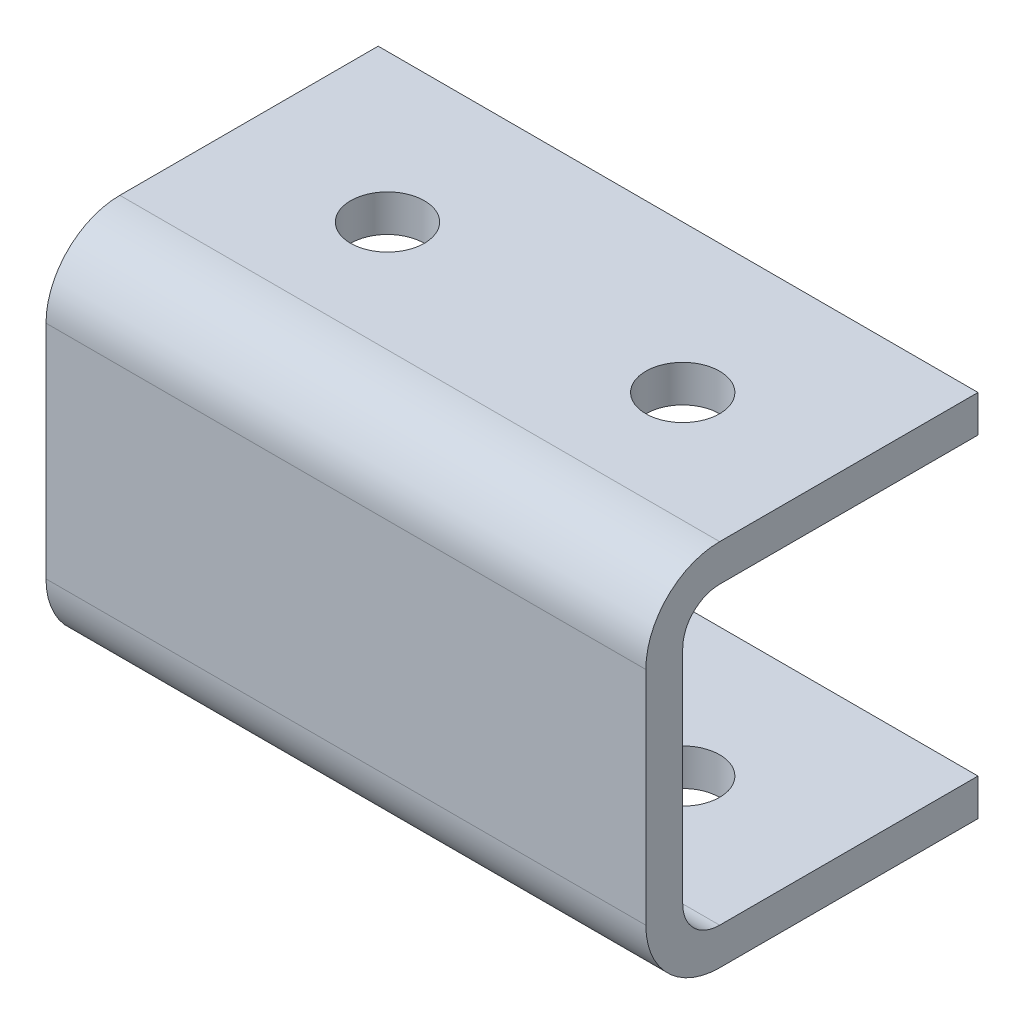
ISO-10303-21;
HEADER;
FILE_DESCRIPTION(('STEP AP214'),'2;1');
FILE_NAME('part.step','',(''),(''),'','','');
FILE_SCHEMA(('AUTOMOTIVE_DESIGN { 1 0 10303 214 1 1 1 1 }'));
ENDSEC;
DATA;
#1=APPLICATION_CONTEXT('core data for automotive mechanical design processes');
#2=APPLICATION_PROTOCOL_DEFINITION('international standard','automotive_design',2000,#1);
#3=PRODUCT_CONTEXT('',#1,'mechanical');
#4=PRODUCT('Part','Part','',(#3));
#5=PRODUCT_RELATED_PRODUCT_CATEGORY('part','',(#4));
#6=PRODUCT_DEFINITION_FORMATION('','',#4);
#7=PRODUCT_DEFINITION_CONTEXT('part definition',#1,'design');
#8=PRODUCT_DEFINITION('design','',#6,#7);
#9=PRODUCT_DEFINITION_SHAPE('','',#8);
#10=(LENGTH_UNIT() NAMED_UNIT(*) SI_UNIT(.MILLI.,.METRE.));
#11=(NAMED_UNIT(*) PLANE_ANGLE_UNIT() SI_UNIT($,.RADIAN.));
#12=(NAMED_UNIT(*) SI_UNIT($,.STERADIAN.) SOLID_ANGLE_UNIT());
#13=UNCERTAINTY_MEASURE_WITH_UNIT(LENGTH_MEASURE(1.E-05),#10,'distance_accuracy_value','');
#14=(GEOMETRIC_REPRESENTATION_CONTEXT(3) GLOBAL_UNCERTAINTY_ASSIGNED_CONTEXT((#13)) GLOBAL_UNIT_ASSIGNED_CONTEXT((#10,
#11,#12)) REPRESENTATION_CONTEXT('',''));
#15=CARTESIAN_POINT('',(0.,0.,0.));
#16=DIRECTION('',(0.,0.,1.));
#17=DIRECTION('',(1.,0.,0.));
#18=AXIS2_PLACEMENT_3D('',#15,#16,#17);
#19=CARTESIAN_POINT('',(872.981011996506,-4.02704283352276,-25.4));
#20=DIRECTION('',(0.,-1.,0.));
#21=DIRECTION('',(0.,0.,-1.));
#22=AXIS2_PLACEMENT_3D('',#19,#20,#21);
#23=PLANE('',#22);
#24=CARTESIAN_POINT('',(860.280011996506,-4.02704283352274,-12.7000000000001));
#25=DIRECTION('',(0.,1.,0.));
#26=DIRECTION('',(0.,0.,1.));
#27=AXIS2_PLACEMENT_3D('',#24,#25,#26);
#28=CIRCLE('',#27,3.17500000000001);
#29=CARTESIAN_POINT('',(860.280011996506,-4.02704283352273,-9.52500000000011));
#30=VERTEX_POINT('',#29);
#31=EDGE_CURVE('E175',#30,#30,#28,.T.);
#32=ORIENTED_EDGE('',*,*,#31,.F.);
#33=EDGE_LOOP('',(#32));
#34=FACE_BOUND('',#33,.T.);
#35=CARTESIAN_POINT('',(834.880011996506,-4.02704283352274,-12.7000000000001));
#36=DIRECTION('',(0.,1.,0.));
#37=DIRECTION('',(0.,0.,1.));
#38=AXIS2_PLACEMENT_3D('',#35,#36,#37);
#39=CIRCLE('',#38,3.17500000000001);
#40=CARTESIAN_POINT('',(834.880011996506,-4.02704283352273,-9.52500000000011));
#41=VERTEX_POINT('',#40);
#42=EDGE_CURVE('E169',#41,#41,#39,.T.);
#43=ORIENTED_EDGE('',*,*,#42,.F.);
#44=EDGE_LOOP('',(#43));
#45=FACE_BOUND('',#44,.T.);
#46=DIRECTION('',(-1.,0.,0.));
#47=VECTOR('',#46,1.);
#48=CARTESIAN_POINT('',(872.981011996506,-4.02704283352276,-25.4));
#49=LINE('',#48,#47);
#50=CARTESIAN_POINT('',(872.980011996506,-4.02704283352276,-25.4));
#51=VERTEX_POINT('',#50);
#52=CARTESIAN_POINT('',(821.380011996506,-4.02704283352282,-25.4));
#53=VERTEX_POINT('',#52);
#54=EDGE_CURVE('E155',#51,#53,#49,.T.);
#55=ORIENTED_EDGE('',*,*,#54,.T.);
#56=DIRECTION('',(0.,0.,1.));
#57=VECTOR('',#56,1.);
#58=CARTESIAN_POINT('',(821.380011996506,-4.02704283352276,-25.4));
#59=LINE('',#58,#57);
#60=CARTESIAN_POINT('',(821.380011996506,-4.02704283352272,-3.17499999999999));
#61=VERTEX_POINT('',#60);
#62=EDGE_CURVE('E287',#53,#61,#59,.T.);
#63=ORIENTED_EDGE('',*,*,#62,.T.);
#64=DIRECTION('',(-1.,0.,0.));
#65=VECTOR('',#64,1.);
#66=CARTESIAN_POINT('',(872.980011996506,-4.02704283352272,-3.17499999999999));
#67=LINE('',#66,#65);
#68=CARTESIAN_POINT('',(872.980011996506,-4.02704283352272,-3.17499999999999));
#69=VERTEX_POINT('',#68);
#70=EDGE_CURVE('E191',#61,#69,#67,.F.);
#71=ORIENTED_EDGE('',*,*,#70,.T.);
#72=DIRECTION('',(0.,0.,1.));
#73=VECTOR('',#72,1.);
#74=CARTESIAN_POINT('',(872.980011996506,-4.02704283352276,-25.4));
#75=LINE('',#74,#73);
#76=EDGE_CURVE('E285',#51,#69,#75,.T.);
#77=ORIENTED_EDGE('',*,*,#76,.F.);
#78=EDGE_LOOP('',(#55,#63,#71,#77));
#79=FACE_BOUND('',#78,.T.);
#80=ADVANCED_FACE('F34',(#34,#45,#79),#23,.F.);
#81=CARTESIAN_POINT('',(872.980011996506,-7.20204283352271,-25.4));
#82=DIRECTION('',(0.,0.,1.));
#83=DIRECTION('',(1.,0.,0.));
#84=AXIS2_PLACEMENT_3D('',#81,#82,#83);
#85=PLANE('',#84);
#86=DIRECTION('',(-1.,0.,0.));
#87=VECTOR('',#86,1.);
#88=CARTESIAN_POINT('',(872.981011996506,21.3729571664772,-25.4));
#89=LINE('',#88,#87);
#90=CARTESIAN_POINT('',(872.980011996506,21.3729571664772,-25.4));
#91=VERTEX_POINT('',#90);
#92=CARTESIAN_POINT('',(821.380011996506,21.3729571664772,-25.4));
#93=VERTEX_POINT('',#92);
#94=EDGE_CURVE('E135',#91,#93,#89,.T.);
#95=ORIENTED_EDGE('',*,*,#94,.T.);
#96=DIRECTION('',(0.,1.,0.));
#97=VECTOR('',#96,1.);
#98=CARTESIAN_POINT('',(821.380011996506,-161.452042833523,-25.4));
#99=LINE('',#98,#97);
#100=CARTESIAN_POINT('',(821.380011996506,24.5479571664772,-25.4));
#101=VERTEX_POINT('',#100);
#102=EDGE_CURVE('E124',#93,#101,#99,.T.);
#103=ORIENTED_EDGE('',*,*,#102,.T.);
#104=DIRECTION('',(-1.,0.,0.));
#105=VECTOR('',#104,1.);
#106=CARTESIAN_POINT('',(872.980011996506,24.5479571664772,-25.4));
#107=LINE('',#106,#105);
#108=CARTESIAN_POINT('',(872.980011996506,24.5479571664772,-25.4));
#109=VERTEX_POINT('',#108);
#110=EDGE_CURVE('E133',#109,#101,#107,.T.);
#111=ORIENTED_EDGE('',*,*,#110,.F.);
#112=DIRECTION('',(0.,1.,0.));
#113=VECTOR('',#112,1.);
#114=CARTESIAN_POINT('',(872.980011996506,-7.20204283352271,-25.4));
#115=LINE('',#114,#113);
#116=EDGE_CURVE('E147',#91,#109,#115,.T.);
#117=ORIENTED_EDGE('',*,*,#116,.F.);
#118=EDGE_LOOP('',(#95,#103,#111,#117));
#119=FACE_BOUND('',#118,.T.);
#120=ADVANCED_FACE('F131',(#119),#85,.F.);
#121=CARTESIAN_POINT('',(-16.0199880034941,-7.20204283352271,-25.4));
#122=DIRECTION('',(0.,-1.,0.));
#123=DIRECTION('',(0.,0.,-1.));
#124=AXIS2_PLACEMENT_3D('',#121,#122,#123);
#125=PLANE('',#124);
#126=DIRECTION('',(0.,0.,1.));
#127=VECTOR('',#126,1.);
#128=CARTESIAN_POINT('',(821.380011996506,-7.20204283352271,-25.4));
#129=LINE('',#128,#127);
#130=CARTESIAN_POINT('',(821.380011996506,-7.20204283352283,-25.4));
#131=VERTEX_POINT('',#130);
#132=CARTESIAN_POINT('',(821.380011996506,-7.20204283352271,-3.175));
#133=VERTEX_POINT('',#132);
#134=EDGE_CURVE('E317',#131,#133,#129,.T.);
#135=ORIENTED_EDGE('',*,*,#134,.F.);
#136=DIRECTION('',(1.,0.,0.));
#137=VECTOR('',#136,1.);
#138=CARTESIAN_POINT('',(-16.0199880034941,-7.20204283352271,-25.4));
#139=LINE('',#138,#137);
#140=CARTESIAN_POINT('',(872.980011996506,-7.20204283352271,-25.4));
#141=VERTEX_POINT('',#140);
#142=EDGE_CURVE('E154',#131,#141,#139,.T.);
#143=ORIENTED_EDGE('',*,*,#142,.T.);
#144=DIRECTION('',(0.,0.,1.));
#145=VECTOR('',#144,1.);
#146=CARTESIAN_POINT('',(872.980011996506,-7.20204283352271,-25.4));
#147=LINE('',#146,#145);
#148=CARTESIAN_POINT('',(872.980011996506,-7.20204283352271,-3.175));
#149=VERTEX_POINT('',#148);
#150=EDGE_CURVE('E141',#141,#149,#147,.T.);
#151=ORIENTED_EDGE('',*,*,#150,.T.);
#152=DIRECTION('',(1.,0.,0.));
#153=VECTOR('',#152,1.);
#154=CARTESIAN_POINT('',(-16.0199880034941,-7.20204283352271,-3.175));
#155=LINE('',#154,#153);
#156=EDGE_CURVE('E199',#149,#133,#155,.F.);
#157=ORIENTED_EDGE('',*,*,#156,.T.);
#158=EDGE_LOOP('',(#135,#143,#151,#157));
#159=FACE_BOUND('',#158,.T.);
#160=CARTESIAN_POINT('',(860.280011996506,-7.20204283352271,-12.7000000000001));
#161=DIRECTION('',(0.,-1.,0.));
#162=DIRECTION('',(0.,0.,-1.));
#163=AXIS2_PLACEMENT_3D('',#160,#161,#162);
#164=CIRCLE('',#163,3.17500000000001);
#165=CARTESIAN_POINT('',(860.280011996506,-7.20204283352271,-15.8750000000001));
#166=VERTEX_POINT('',#165);
#167=EDGE_CURVE('E178',#166,#166,#164,.T.);
#168=ORIENTED_EDGE('',*,*,#167,.F.);
#169=EDGE_LOOP('',(#168));
#170=FACE_BOUND('',#169,.T.);
#171=CARTESIAN_POINT('',(834.880011996506,-7.20204283352271,-12.7000000000001));
#172=DIRECTION('',(0.,-1.,0.));
#173=DIRECTION('',(0.,0.,-1.));
#174=AXIS2_PLACEMENT_3D('',#171,#172,#173);
#175=CIRCLE('',#174,3.17500000000001);
#176=CARTESIAN_POINT('',(834.880011996506,-7.20204283352271,-15.8750000000001));
#177=VERTEX_POINT('',#176);
#178=EDGE_CURVE('E172',#177,#177,#175,.T.);
#179=ORIENTED_EDGE('',*,*,#178,.F.);
#180=EDGE_LOOP('',(#179));
#181=FACE_BOUND('',#180,.T.);
#182=ADVANCED_FACE('F233',(#159,#170,#181),#125,.T.);
#183=CARTESIAN_POINT('',(872.980011996506,24.5479571664772,-25.4));
#184=DIRECTION('',(0.,1.,0.));
#185=DIRECTION('',(-1.,0.,0.));
#186=AXIS2_PLACEMENT_3D('',#183,#184,#185);
#187=PLANE('',#186);
#188=DIRECTION('',(0.,0.,-1.));
#189=VECTOR('',#188,1.);
#190=CARTESIAN_POINT('',(821.380011996506,24.5479571664772,-25.4));
#191=LINE('',#190,#189);
#192=CARTESIAN_POINT('',(821.380011996506,24.5479571664772,-3.175));
#193=VERTEX_POINT('',#192);
#194=EDGE_CURVE('E121',#193,#101,#191,.T.);
#195=ORIENTED_EDGE('',*,*,#194,.F.);
#196=DIRECTION('',(-1.,0.,0.));
#197=VECTOR('',#196,1.);
#198=CARTESIAN_POINT('',(872.980011996506,24.5479571664772,-3.175));
#199=LINE('',#198,#197);
#200=CARTESIAN_POINT('',(872.980011996506,24.5479571664772,-3.175));
#201=VERTEX_POINT('',#200);
#202=EDGE_CURVE('E56',#193,#201,#199,.F.);
#203=ORIENTED_EDGE('',*,*,#202,.T.);
#204=DIRECTION('',(0.,0.,1.));
#205=VECTOR('',#204,1.);
#206=CARTESIAN_POINT('',(872.980011996506,24.5479571664772,-25.4));
#207=LINE('',#206,#205);
#208=EDGE_CURVE('E140',#109,#201,#207,.T.);
#209=ORIENTED_EDGE('',*,*,#208,.F.);
#210=ORIENTED_EDGE('',*,*,#110,.T.);
#211=EDGE_LOOP('',(#195,#203,#209,#210));
#212=FACE_BOUND('',#211,.T.);
#213=CARTESIAN_POINT('',(860.280011996506,24.5479571664772,-12.7000000000001));
#214=DIRECTION('',(0.,1.,0.));
#215=DIRECTION('',(0.,0.,1.));
#216=AXIS2_PLACEMENT_3D('',#213,#214,#215);
#217=CIRCLE('',#216,3.17500000000001);
#218=CARTESIAN_POINT('',(860.280011996506,24.5479571664772,-9.52500000000005));
#219=VERTEX_POINT('',#218);
#220=EDGE_CURVE('E166',#219,#219,#217,.T.);
#221=ORIENTED_EDGE('',*,*,#220,.F.);
#222=EDGE_LOOP('',(#221));
#223=FACE_BOUND('',#222,.T.);
#224=CARTESIAN_POINT('',(834.880011996506,24.5479571664772,-12.7000000000001));
#225=DIRECTION('',(0.,1.,0.));
#226=DIRECTION('',(0.,0.,1.));
#227=AXIS2_PLACEMENT_3D('',#224,#225,#226);
#228=CIRCLE('',#227,3.17500000000001);
#229=CARTESIAN_POINT('',(834.880011996506,24.5479571664772,-9.52500000000005));
#230=VERTEX_POINT('',#229);
#231=EDGE_CURVE('E160',#230,#230,#228,.T.);
#232=ORIENTED_EDGE('',*,*,#231,.F.);
#233=EDGE_LOOP('',(#232));
#234=FACE_BOUND('',#233,.T.);
#235=ADVANCED_FACE('F138',(#212,#223,#234),#187,.T.);
#236=ORIENTED_EDGE('',*,*,#142,.F.);
#237=EDGE_CURVE('E136',#131,#53,#99,.T.);
#238=ORIENTED_EDGE('',*,*,#237,.T.);
#239=ORIENTED_EDGE('',*,*,#54,.F.);
#240=EDGE_CURVE('E142',#141,#51,#115,.T.);
#241=ORIENTED_EDGE('',*,*,#240,.F.);
#242=EDGE_LOOP('',(#236,#238,#239,#241));
#243=FACE_BOUND('',#242,.T.);
#244=ADVANCED_FACE('F235',(#243),#85,.F.);
#245=CARTESIAN_POINT('',(872.980011996506,-7.20204283352271,3.175));
#246=DIRECTION('',(0.,0.,1.));
#247=DIRECTION('',(1.,0.,0.));
#248=AXIS2_PLACEMENT_3D('',#245,#246,#247);
#249=PLANE('',#248);
#250=DIRECTION('',(0.,1.,0.));
#251=VECTOR('',#250,1.);
#252=CARTESIAN_POINT('',(821.380011996506,-7.20204283352271,3.175));
#253=LINE('',#252,#251);
#254=CARTESIAN_POINT('',(821.380011996506,-0.852042833522709,3.175));
#255=VERTEX_POINT('',#254);
#256=CARTESIAN_POINT('',(821.380011996506,18.1979571664772,3.175));
#257=VERTEX_POINT('',#256);
#258=EDGE_CURVE('E48',#255,#257,#253,.T.);
#259=ORIENTED_EDGE('',*,*,#258,.F.);
#260=DIRECTION('',(1.,0.,0.));
#261=VECTOR('',#260,1.);
#262=CARTESIAN_POINT('',(872.980011996506,-0.852042833522709,3.175));
#263=LINE('',#262,#261);
#264=CARTESIAN_POINT('',(872.980011996506,-0.852042833522709,3.175));
#265=VERTEX_POINT('',#264);
#266=EDGE_CURVE('E195',#255,#265,#263,.T.);
#267=ORIENTED_EDGE('',*,*,#266,.T.);
#268=DIRECTION('',(0.,1.,0.));
#269=VECTOR('',#268,1.);
#270=CARTESIAN_POINT('',(872.980011996506,-7.20204283352271,3.175));
#271=LINE('',#270,#269);
#272=CARTESIAN_POINT('',(872.980011996506,18.1979571664772,3.175));
#273=VERTEX_POINT('',#272);
#274=EDGE_CURVE('E151',#265,#273,#271,.T.);
#275=ORIENTED_EDGE('',*,*,#274,.T.);
#276=DIRECTION('',(-1.,0.,0.));
#277=VECTOR('',#276,1.);
#278=CARTESIAN_POINT('',(872.980011996506,18.1979571664772,3.175));
#279=LINE('',#278,#277);
#280=EDGE_CURVE('E202',#273,#257,#279,.T.);
#281=ORIENTED_EDGE('',*,*,#280,.T.);
#282=EDGE_LOOP('',(#259,#267,#275,#281));
#283=FACE_BOUND('',#282,.T.);
#284=ADVANCED_FACE('F212',(#283),#249,.T.);
#285=CARTESIAN_POINT('',(872.981011996506,21.3729571664772,0.));
#286=DIRECTION('',(0.,1.,0.));
#287=DIRECTION('',(0.,0.,1.));
#288=AXIS2_PLACEMENT_3D('',#285,#286,#287);
#289=PLANE('',#288);
#290=CARTESIAN_POINT('',(860.280011996506,21.3729571664772,-12.7000000000001));
#291=DIRECTION('',(0.,1.,0.));
#292=DIRECTION('',(0.,0.,1.));
#293=AXIS2_PLACEMENT_3D('',#290,#291,#292);
#294=CIRCLE('',#293,3.17500000000001);
#295=CARTESIAN_POINT('',(860.280011996506,21.3729571664772,-9.52500000000005));
#296=VERTEX_POINT('',#295);
#297=EDGE_CURVE('E163',#296,#296,#294,.T.);
#298=ORIENTED_EDGE('',*,*,#297,.T.);
#299=EDGE_LOOP('',(#298));
#300=FACE_BOUND('',#299,.T.);
#301=CARTESIAN_POINT('',(834.880011996506,21.3729571664772,-12.7000000000001));
#302=DIRECTION('',(0.,1.,0.));
#303=DIRECTION('',(0.,0.,1.));
#304=AXIS2_PLACEMENT_3D('',#301,#302,#303);
#305=CIRCLE('',#304,3.17500000000001);
#306=CARTESIAN_POINT('',(834.880011996506,21.3729571664772,-9.52500000000005));
#307=VERTEX_POINT('',#306);
#308=EDGE_CURVE('E156',#307,#307,#305,.T.);
#309=ORIENTED_EDGE('',*,*,#308,.T.);
#310=EDGE_LOOP('',(#309));
#311=FACE_BOUND('',#310,.T.);
#312=DIRECTION('',(-1.,0.,0.));
#313=VECTOR('',#312,1.);
#314=CARTESIAN_POINT('',(-16.0199880034941,21.3729571664772,-3.175));
#315=LINE('',#314,#313);
#316=CARTESIAN_POINT('',(872.980011996506,21.3729571664772,-3.175));
#317=VERTEX_POINT('',#316);
#318=CARTESIAN_POINT('',(821.380011996506,21.3729571664772,-3.175));
#319=VERTEX_POINT('',#318);
#320=EDGE_CURVE('E181',#317,#319,#315,.T.);
#321=ORIENTED_EDGE('',*,*,#320,.T.);
#322=DIRECTION('',(0.,0.,-1.));
#323=VECTOR('',#322,1.);
#324=CARTESIAN_POINT('',(821.380011996506,21.3729571664772,0.));
#325=LINE('',#324,#323);
#326=EDGE_CURVE('E293',#319,#93,#325,.T.);
#327=ORIENTED_EDGE('',*,*,#326,.T.);
#328=ORIENTED_EDGE('',*,*,#94,.F.);
#329=DIRECTION('',(0.,0.,-1.));
#330=VECTOR('',#329,1.);
#331=CARTESIAN_POINT('',(872.980011996506,21.3729571664772,0.));
#332=LINE('',#331,#330);
#333=EDGE_CURVE('E295',#317,#91,#332,.T.);
#334=ORIENTED_EDGE('',*,*,#333,.F.);
#335=EDGE_LOOP('',(#321,#327,#328,#334));
#336=FACE_BOUND('',#335,.T.);
#337=ADVANCED_FACE('F242',(#300,#311,#336),#289,.F.);
#338=CARTESIAN_POINT('',(872.981011996506,-4.02704283352271,0.));
#339=DIRECTION('',(0.,0.,1.));
#340=DIRECTION('',(1.,0.,0.));
#341=AXIS2_PLACEMENT_3D('',#338,#339,#340);
#342=PLANE('',#341);
#343=DIRECTION('',(-1.,0.,0.));
#344=VECTOR('',#343,1.);
#345=CARTESIAN_POINT('',(-16.0199880034941,-0.852042833522716,0.));
#346=LINE('',#345,#344);
#347=CARTESIAN_POINT('',(872.980011996506,-0.852042833522716,0.));
#348=VERTEX_POINT('',#347);
#349=CARTESIAN_POINT('',(821.380011996506,-0.852042833522716,0.));
#350=VERTEX_POINT('',#349);
#351=EDGE_CURVE('E188',#348,#350,#346,.T.);
#352=ORIENTED_EDGE('',*,*,#351,.T.);
#353=DIRECTION('',(0.,1.,0.));
#354=VECTOR('',#353,1.);
#355=CARTESIAN_POINT('',(821.380011996506,-4.02704283352271,0.));
#356=LINE('',#355,#354);
#357=CARTESIAN_POINT('',(821.380011996506,18.1979571664772,0.));
#358=VERTEX_POINT('',#357);
#359=EDGE_CURVE('E312',#350,#358,#356,.T.);
#360=ORIENTED_EDGE('',*,*,#359,.T.);
#361=DIRECTION('',(-1.,0.,0.));
#362=VECTOR('',#361,1.);
#363=CARTESIAN_POINT('',(872.980011996506,18.1979571664772,0.));
#364=LINE('',#363,#362);
#365=CARTESIAN_POINT('',(872.980011996506,18.1979571664772,0.));
#366=VERTEX_POINT('',#365);
#367=EDGE_CURVE('E184',#358,#366,#364,.F.);
#368=ORIENTED_EDGE('',*,*,#367,.T.);
#369=DIRECTION('',(0.,1.,0.));
#370=VECTOR('',#369,1.);
#371=CARTESIAN_POINT('',(872.980011996506,-4.02704283352271,0.));
#372=LINE('',#371,#370);
#373=EDGE_CURVE('E292',#348,#366,#372,.T.);
#374=ORIENTED_EDGE('',*,*,#373,.F.);
#375=EDGE_LOOP('',(#352,#360,#368,#374));
#376=FACE_BOUND('',#375,.T.);
#377=ADVANCED_FACE('F240',(#376),#342,.F.);
#378=CARTESIAN_POINT('',(872.981011996506,18.1979571664772,-3.175));
#379=DIRECTION('',(1.,0.,0.));
#380=DIRECTION('',(0.,0.,-1.));
#381=AXIS2_PLACEMENT_3D('',#378,#379,#380);
#382=CYLINDRICAL_SURFACE('',#381,3.175);
#383=ORIENTED_EDGE('',*,*,#367,.F.);
#384=CARTESIAN_POINT('',(821.380011996506,18.1979571664772,-3.175));
#385=DIRECTION('',(1.,0.,0.));
#386=DIRECTION('',(0.,1.,0.));
#387=AXIS2_PLACEMENT_3D('',#384,#385,#386);
#388=CIRCLE('',#387,3.175);
#389=EDGE_CURVE('E297',#358,#319,#388,.F.);
#390=ORIENTED_EDGE('',*,*,#389,.T.);
#391=ORIENTED_EDGE('',*,*,#320,.F.);
#392=CARTESIAN_POINT('',(872.980011996506,18.1979571664772,-3.175));
#393=DIRECTION('',(1.,0.,0.));
#394=DIRECTION('',(0.,0.,-1.));
#395=AXIS2_PLACEMENT_3D('',#392,#393,#394);
#396=CIRCLE('',#395,3.175);
#397=EDGE_CURVE('E186',#366,#317,#396,.F.);
#398=ORIENTED_EDGE('',*,*,#397,.F.);
#399=EDGE_LOOP('',(#383,#390,#391,#398));
#400=FACE_BOUND('',#399,.T.);
#401=ADVANCED_FACE('F268',(#400),#382,.F.);
#402=CARTESIAN_POINT('',(872.981011996506,-0.852042833522716,-3.175));
#403=DIRECTION('',(1.,0.,0.));
#404=DIRECTION('',(0.,0.,-1.));
#405=AXIS2_PLACEMENT_3D('',#402,#403,#404);
#406=CYLINDRICAL_SURFACE('',#405,3.175);
#407=ORIENTED_EDGE('',*,*,#70,.F.);
#408=CARTESIAN_POINT('',(821.380011996506,-0.852042833522716,-3.175));
#409=DIRECTION('',(1.,0.,0.));
#410=DIRECTION('',(0.,1.,0.));
#411=AXIS2_PLACEMENT_3D('',#408,#409,#410);
#412=CIRCLE('',#411,3.175);
#413=EDGE_CURVE('E280',#61,#350,#412,.F.);
#414=ORIENTED_EDGE('',*,*,#413,.T.);
#415=ORIENTED_EDGE('',*,*,#351,.F.);
#416=CARTESIAN_POINT('',(872.980011996506,-0.852042833522716,-3.175));
#417=DIRECTION('',(1.,0.,0.));
#418=DIRECTION('',(0.,0.,-1.));
#419=AXIS2_PLACEMENT_3D('',#416,#417,#418);
#420=CIRCLE('',#419,3.175);
#421=EDGE_CURVE('E193',#69,#348,#420,.F.);
#422=ORIENTED_EDGE('',*,*,#421,.F.);
#423=EDGE_LOOP('',(#407,#414,#415,#422));
#424=FACE_BOUND('',#423,.T.);
#425=ADVANCED_FACE('F224',(#424),#406,.F.);
#426=CARTESIAN_POINT('',(872.980011996506,-0.852042833522709,-3.175));
#427=DIRECTION('',(1.,0.,0.));
#428=DIRECTION('',(0.,0.,-1.));
#429=AXIS2_PLACEMENT_3D('',#426,#427,#428);
#430=CYLINDRICAL_SURFACE('',#429,6.35);
#431=CARTESIAN_POINT('',(821.380011996506,-0.852042833522709,-3.175));
#432=DIRECTION('',(1.,0.,0.));
#433=DIRECTION('',(0.,1.,0.));
#434=AXIS2_PLACEMENT_3D('',#431,#432,#433);
#435=CIRCLE('',#434,6.35);
#436=EDGE_CURVE('E319',#133,#255,#435,.F.);
#437=ORIENTED_EDGE('',*,*,#436,.F.);
#438=ORIENTED_EDGE('',*,*,#156,.F.);
#439=CARTESIAN_POINT('',(872.980011996506,-0.852042833522709,-3.175));
#440=DIRECTION('',(1.,0.,0.));
#441=DIRECTION('',(0.,0.,-1.));
#442=AXIS2_PLACEMENT_3D('',#439,#440,#441);
#443=CIRCLE('',#442,6.35);
#444=EDGE_CURVE('E197',#265,#149,#443,.T.);
#445=ORIENTED_EDGE('',*,*,#444,.F.);
#446=ORIENTED_EDGE('',*,*,#266,.F.);
#447=EDGE_LOOP('',(#437,#438,#445,#446));
#448=FACE_BOUND('',#447,.T.);
#449=ADVANCED_FACE('F216',(#448),#430,.T.);
#450=CARTESIAN_POINT('',(872.980011996506,18.1979571664772,-3.175));
#451=DIRECTION('',(-1.,0.,0.));
#452=DIRECTION('',(0.,-1.,0.));
#453=AXIS2_PLACEMENT_3D('',#450,#451,#452);
#454=CYLINDRICAL_SURFACE('',#453,6.35);
#455=CARTESIAN_POINT('',(821.380011996506,18.1979571664772,-3.175));
#456=DIRECTION('',(1.,0.,0.));
#457=DIRECTION('',(0.,1.,0.));
#458=AXIS2_PLACEMENT_3D('',#455,#456,#457);
#459=CIRCLE('',#458,6.35);
#460=EDGE_CURVE('E11',#257,#193,#459,.F.);
#461=ORIENTED_EDGE('',*,*,#460,.F.);
#462=ORIENTED_EDGE('',*,*,#280,.F.);
#463=CARTESIAN_POINT('',(872.980011996506,18.1979571664772,-3.175));
#464=DIRECTION('',(1.,0.,0.));
#465=DIRECTION('',(0.,0.,-1.));
#466=AXIS2_PLACEMENT_3D('',#463,#464,#465);
#467=CIRCLE('',#466,6.35);
#468=EDGE_CURVE('E42',#201,#273,#467,.T.);
#469=ORIENTED_EDGE('',*,*,#468,.F.);
#470=ORIENTED_EDGE('',*,*,#202,.F.);
#471=EDGE_LOOP('',(#461,#462,#469,#470));
#472=FACE_BOUND('',#471,.T.);
#473=ADVANCED_FACE('F36',(#472),#454,.T.);
#474=CARTESIAN_POINT('',(872.980011996506,-7.20204283352271,-25.4));
#475=DIRECTION('',(1.,0.,0.));
#476=DIRECTION('',(0.,0.,-1.));
#477=AXIS2_PLACEMENT_3D('',#474,#475,#476);
#478=PLANE('',#477);
#479=ORIENTED_EDGE('',*,*,#208,.T.);
#480=ORIENTED_EDGE('',*,*,#468,.T.);
#481=ORIENTED_EDGE('',*,*,#274,.F.);
#482=ORIENTED_EDGE('',*,*,#444,.T.);
#483=ORIENTED_EDGE('',*,*,#150,.F.);
#484=ORIENTED_EDGE('',*,*,#240,.T.);
#485=ORIENTED_EDGE('',*,*,#76,.T.);
#486=ORIENTED_EDGE('',*,*,#421,.T.);
#487=ORIENTED_EDGE('',*,*,#373,.T.);
#488=ORIENTED_EDGE('',*,*,#397,.T.);
#489=ORIENTED_EDGE('',*,*,#333,.T.);
#490=ORIENTED_EDGE('',*,*,#116,.T.);
#491=EDGE_LOOP('',(#479,#480,#481,#482,#483,#484,#485,#486,#487,#488,#489,#490));
#492=FACE_BOUND('',#491,.T.);
#493=ADVANCED_FACE('F208',(#492),#478,.T.);
#494=CARTESIAN_POINT('',(834.880011996506,24.5479571664772,-12.7000000000001));
#495=DIRECTION('',(0.,1.,0.));
#496=DIRECTION('',(0.,0.,1.));
#497=AXIS2_PLACEMENT_3D('',#494,#495,#496);
#498=CYLINDRICAL_SURFACE('',#497,3.17500000000001);
#499=ORIENTED_EDGE('',*,*,#308,.F.);
#500=EDGE_LOOP('',(#499));
#501=FACE_BOUND('',#500,.T.);
#502=ORIENTED_EDGE('',*,*,#231,.T.);
#503=EDGE_LOOP('',(#502));
#504=FACE_BOUND('',#503,.T.);
#505=ADVANCED_FACE('F222',(#501,#504),#498,.F.);
#506=CARTESIAN_POINT('',(860.280011996506,24.5479571664772,-12.7000000000001));
#507=DIRECTION('',(0.,1.,0.));
#508=DIRECTION('',(0.,0.,1.));
#509=AXIS2_PLACEMENT_3D('',#506,#507,#508);
#510=CYLINDRICAL_SURFACE('',#509,3.17500000000001);
#511=ORIENTED_EDGE('',*,*,#297,.F.);
#512=EDGE_LOOP('',(#511));
#513=FACE_BOUND('',#512,.T.);
#514=ORIENTED_EDGE('',*,*,#220,.T.);
#515=EDGE_LOOP('',(#514));
#516=FACE_BOUND('',#515,.T.);
#517=ADVANCED_FACE('F255',(#513,#516),#510,.F.);
#518=CARTESIAN_POINT('',(834.880011996506,-4.02704283352274,-12.7000000000001));
#519=DIRECTION('',(0.,1.,0.));
#520=DIRECTION('',(0.,0.,1.));
#521=AXIS2_PLACEMENT_3D('',#518,#519,#520);
#522=CYLINDRICAL_SURFACE('',#521,3.17500000000001);
#523=ORIENTED_EDGE('',*,*,#42,.T.);
#524=EDGE_LOOP('',(#523));
#525=FACE_BOUND('',#524,.T.);
#526=ORIENTED_EDGE('',*,*,#178,.T.);
#527=EDGE_LOOP('',(#526));
#528=FACE_BOUND('',#527,.T.);
#529=ADVANCED_FACE('F259',(#525,#528),#522,.F.);
#530=CARTESIAN_POINT('',(860.280011996506,-4.02704283352274,-12.7000000000001));
#531=DIRECTION('',(0.,1.,0.));
#532=DIRECTION('',(0.,0.,1.));
#533=AXIS2_PLACEMENT_3D('',#530,#531,#532);
#534=CYLINDRICAL_SURFACE('',#533,3.17500000000001);
#535=ORIENTED_EDGE('',*,*,#31,.T.);
#536=EDGE_LOOP('',(#535));
#537=FACE_BOUND('',#536,.T.);
#538=ORIENTED_EDGE('',*,*,#167,.T.);
#539=EDGE_LOOP('',(#538));
#540=FACE_BOUND('',#539,.T.);
#541=ADVANCED_FACE('F263',(#537,#540),#534,.F.);
#542=CARTESIAN_POINT('',(821.380011996506,-161.452042833523,-25.4));
#543=DIRECTION('',(1.,0.,0.));
#544=DIRECTION('',(0.,1.,0.));
#545=AXIS2_PLACEMENT_3D('',#542,#543,#544);
#546=PLANE('',#545);
#547=ORIENTED_EDGE('',*,*,#389,.F.);
#548=ORIENTED_EDGE('',*,*,#359,.F.);
#549=ORIENTED_EDGE('',*,*,#413,.F.);
#550=ORIENTED_EDGE('',*,*,#62,.F.);
#551=ORIENTED_EDGE('',*,*,#237,.F.);
#552=ORIENTED_EDGE('',*,*,#134,.T.);
#553=ORIENTED_EDGE('',*,*,#436,.T.);
#554=ORIENTED_EDGE('',*,*,#258,.T.);
#555=ORIENTED_EDGE('',*,*,#460,.T.);
#556=ORIENTED_EDGE('',*,*,#194,.T.);
#557=ORIENTED_EDGE('',*,*,#102,.F.);
#558=ORIENTED_EDGE('',*,*,#326,.F.);
#559=EDGE_LOOP('',(#547,#548,#549,#550,#551,#552,#553,#554,#555,#556,#557,#558));
#560=FACE_BOUND('',#559,.T.);
#561=ADVANCED_FACE('F123',(#560),#546,.F.);
#562=CLOSED_SHELL('',(#80,#120,#182,#235,#244,#284,#337,#377,#401,#425,#449,#473,#493,#505,#517,
#529,#541,#561));
#563=MANIFOLD_SOLID_BREP('B2',#562);
#564=ADVANCED_BREP_SHAPE_REPRESENTATION('',(#18,#563),#14);
#565=SHAPE_DEFINITION_REPRESENTATION(#9,#564);
ENDSEC;
END-ISO-10303-21;
